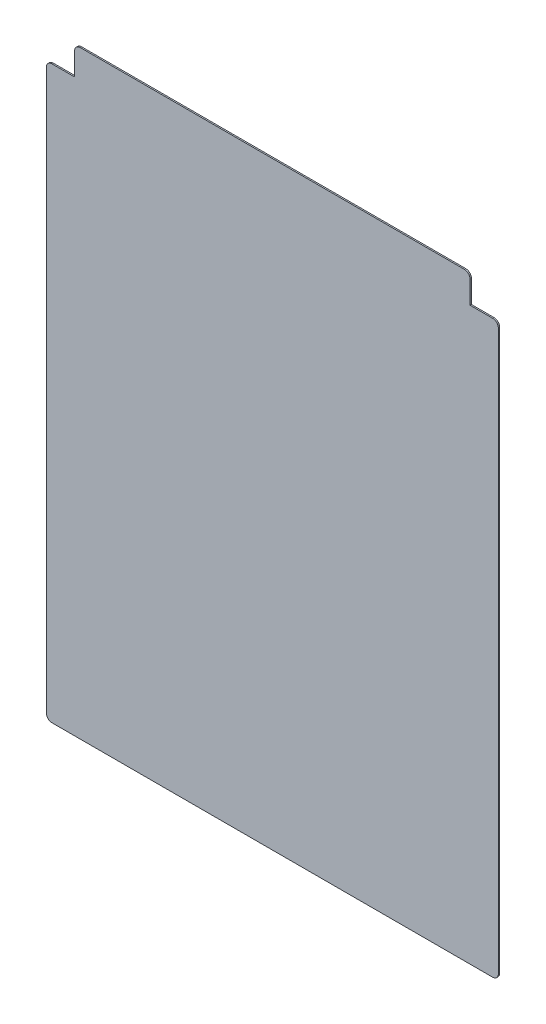
ISO-10303-21;
HEADER;
FILE_DESCRIPTION(('STEP AP214'),'2;1');
FILE_NAME('part.step','',(''),(''),'','','');
FILE_SCHEMA(('AUTOMOTIVE_DESIGN { 1 0 10303 214 1 1 1 1 }'));
ENDSEC;
DATA;
#1=APPLICATION_CONTEXT('core data for automotive mechanical design processes');
#2=APPLICATION_PROTOCOL_DEFINITION('international standard','automotive_design',2000,#1);
#3=PRODUCT_CONTEXT('',#1,'mechanical');
#4=PRODUCT('Part','Part','',(#3));
#5=PRODUCT_RELATED_PRODUCT_CATEGORY('part','',(#4));
#6=PRODUCT_DEFINITION_FORMATION('','',#4);
#7=PRODUCT_DEFINITION_CONTEXT('part definition',#1,'design');
#8=PRODUCT_DEFINITION('design','',#6,#7);
#9=PRODUCT_DEFINITION_SHAPE('','',#8);
#10=(LENGTH_UNIT() NAMED_UNIT(*) SI_UNIT(.MILLI.,.METRE.));
#11=(NAMED_UNIT(*) PLANE_ANGLE_UNIT() SI_UNIT($,.RADIAN.));
#12=(NAMED_UNIT(*) SI_UNIT($,.STERADIAN.) SOLID_ANGLE_UNIT());
#13=UNCERTAINTY_MEASURE_WITH_UNIT(LENGTH_MEASURE(1.E-05),#10,'distance_accuracy_value','');
#14=(GEOMETRIC_REPRESENTATION_CONTEXT(3) GLOBAL_UNCERTAINTY_ASSIGNED_CONTEXT((#13)) GLOBAL_UNIT_ASSIGNED_CONTEXT((#10,
#11,#12)) REPRESENTATION_CONTEXT('',''));
#15=CARTESIAN_POINT('',(0.,0.,0.));
#16=DIRECTION('',(0.,0.,1.));
#17=DIRECTION('',(1.,0.,0.));
#18=AXIS2_PLACEMENT_3D('',#15,#16,#17);
#19=CARTESIAN_POINT('',(-200.,0.,-1.2));
#20=DIRECTION('',(-1.,0.,0.));
#21=DIRECTION('',(0.,0.,1.));
#22=AXIS2_PLACEMENT_3D('',#19,#20,#21);
#23=PLANE('',#22);
#24=DIRECTION('',(0.,-1.,0.));
#25=VECTOR('',#24,1.);
#26=CARTESIAN_POINT('',(-200.,0.,-1.2));
#27=LINE('',#26,#25);
#28=CARTESIAN_POINT('',(-200.,500.,-1.2));
#29=VERTEX_POINT('',#28);
#30=CARTESIAN_POINT('',(-200.,5.,-1.2));
#31=VERTEX_POINT('',#30);
#32=EDGE_CURVE('E187',#29,#31,#27,.T.);
#33=ORIENTED_EDGE('',*,*,#32,.T.);
#34=DIRECTION('',(0.,0.,1.));
#35=VECTOR('',#34,1.);
#36=CARTESIAN_POINT('',(-200.,5.,-1.2));
#37=LINE('',#36,#35);
#38=CARTESIAN_POINT('',(-200.,5.,0.));
#39=VERTEX_POINT('',#38);
#40=EDGE_CURVE('E225',#31,#39,#37,.T.);
#41=ORIENTED_EDGE('',*,*,#40,.T.);
#42=DIRECTION('',(0.,-1.,0.));
#43=VECTOR('',#42,1.);
#44=CARTESIAN_POINT('',(-200.,0.,0.));
#45=LINE('',#44,#43);
#46=CARTESIAN_POINT('',(-200.,500.,0.));
#47=VERTEX_POINT('',#46);
#48=EDGE_CURVE('E167',#47,#39,#45,.T.);
#49=ORIENTED_EDGE('',*,*,#48,.F.);
#50=DIRECTION('',(0.,0.,1.));
#51=VECTOR('',#50,1.);
#52=CARTESIAN_POINT('',(-200.,500.,-1.2));
#53=LINE('',#52,#51);
#54=EDGE_CURVE('E223',#47,#29,#53,.F.);
#55=ORIENTED_EDGE('',*,*,#54,.T.);
#56=EDGE_LOOP('',(#33,#41,#49,#55));
#57=FACE_BOUND('',#56,.T.);
#58=ADVANCED_FACE('F37',(#57),#23,.T.);
#59=CARTESIAN_POINT('',(-200.,505.,-1.2));
#60=DIRECTION('',(0.,1.,0.));
#61=DIRECTION('',(0.,0.,1.));
#62=AXIS2_PLACEMENT_3D('',#59,#60,#61);
#63=PLANE('',#62);
#64=DIRECTION('',(-1.,0.,0.));
#65=VECTOR('',#64,1.);
#66=CARTESIAN_POINT('',(-200.,505.,-1.2));
#67=LINE('',#66,#65);
#68=CARTESIAN_POINT('',(-175.,505.,-1.2));
#69=VERTEX_POINT('',#68);
#70=CARTESIAN_POINT('',(-195.,505.,-1.2));
#71=VERTEX_POINT('',#70);
#72=EDGE_CURVE('E153',#69,#71,#67,.T.);
#73=ORIENTED_EDGE('',*,*,#72,.T.);
#74=DIRECTION('',(0.,0.,1.));
#75=VECTOR('',#74,1.);
#76=CARTESIAN_POINT('',(-195.,505.,-1.2));
#77=LINE('',#76,#75);
#78=CARTESIAN_POINT('',(-195.,505.,0.));
#79=VERTEX_POINT('',#78);
#80=EDGE_CURVE('E228',#71,#79,#77,.T.);
#81=ORIENTED_EDGE('',*,*,#80,.T.);
#82=DIRECTION('',(-1.,0.,0.));
#83=VECTOR('',#82,1.);
#84=CARTESIAN_POINT('',(-200.,505.,0.));
#85=LINE('',#84,#83);
#86=CARTESIAN_POINT('',(-175.,505.,0.));
#87=VERTEX_POINT('',#86);
#88=EDGE_CURVE('E184',#87,#79,#85,.T.);
#89=ORIENTED_EDGE('',*,*,#88,.F.);
#90=DIRECTION('',(0.,0.,1.));
#91=VECTOR('',#90,1.);
#92=CARTESIAN_POINT('',(-175.,505.,-1.2));
#93=LINE('',#92,#91);
#94=EDGE_CURVE('E152',#69,#87,#93,.T.);
#95=ORIENTED_EDGE('',*,*,#94,.F.);
#96=EDGE_LOOP('',(#73,#81,#89,#95));
#97=FACE_BOUND('',#96,.T.);
#98=ADVANCED_FACE('F262',(#97),#63,.T.);
#99=CARTESIAN_POINT('',(-175.,530.,-1.2));
#100=DIRECTION('',(-1.,0.,0.));
#101=DIRECTION('',(0.,0.,1.));
#102=AXIS2_PLACEMENT_3D('',#99,#100,#101);
#103=PLANE('',#102);
#104=DIRECTION('',(0.,-1.,0.));
#105=VECTOR('',#104,1.);
#106=CARTESIAN_POINT('',(-175.,530.,0.));
#107=LINE('',#106,#105);
#108=CARTESIAN_POINT('',(-175.,525.,0.));
#109=VERTEX_POINT('',#108);
#110=EDGE_CURVE('E182',#109,#87,#107,.T.);
#111=ORIENTED_EDGE('',*,*,#110,.F.);
#112=DIRECTION('',(0.,0.,1.));
#113=VECTOR('',#112,1.);
#114=CARTESIAN_POINT('',(-175.,525.,-1.2));
#115=LINE('',#114,#113);
#116=CARTESIAN_POINT('',(-175.,525.,-1.2));
#117=VERTEX_POINT('',#116);
#118=EDGE_CURVE('E236',#109,#117,#115,.F.);
#119=ORIENTED_EDGE('',*,*,#118,.T.);
#120=DIRECTION('',(0.,-1.,0.));
#121=VECTOR('',#120,1.);
#122=CARTESIAN_POINT('',(-175.,530.,-1.2));
#123=LINE('',#122,#121);
#124=EDGE_CURVE('E160',#117,#69,#123,.T.);
#125=ORIENTED_EDGE('',*,*,#124,.T.);
#126=ORIENTED_EDGE('',*,*,#94,.T.);
#127=EDGE_LOOP('',(#111,#119,#125,#126));
#128=FACE_BOUND('',#127,.T.);
#129=ADVANCED_FACE('F241',(#128),#103,.T.);
#130=CARTESIAN_POINT('',(-175.,530.,-1.2));
#131=DIRECTION('',(0.,1.,0.));
#132=DIRECTION('',(0.,0.,1.));
#133=AXIS2_PLACEMENT_3D('',#130,#131,#132);
#134=PLANE('',#133);
#135=DIRECTION('',(-1.,0.,0.));
#136=VECTOR('',#135,1.);
#137=CARTESIAN_POINT('',(-175.,530.,-1.2));
#138=LINE('',#137,#136);
#139=CARTESIAN_POINT('',(170.,530.,-1.2));
#140=VERTEX_POINT('',#139);
#141=CARTESIAN_POINT('',(-170.,530.,-1.2));
#142=VERTEX_POINT('',#141);
#143=EDGE_CURVE('E157',#140,#142,#138,.T.);
#144=ORIENTED_EDGE('',*,*,#143,.T.);
#145=DIRECTION('',(0.,0.,1.));
#146=VECTOR('',#145,1.);
#147=CARTESIAN_POINT('',(-170.,530.,-1.2));
#148=LINE('',#147,#146);
#149=CARTESIAN_POINT('',(-170.,530.,0.));
#150=VERTEX_POINT('',#149);
#151=EDGE_CURVE('E233',#142,#150,#148,.T.);
#152=ORIENTED_EDGE('',*,*,#151,.T.);
#153=DIRECTION('',(-1.,0.,0.));
#154=VECTOR('',#153,1.);
#155=CARTESIAN_POINT('',(-175.,530.,0.));
#156=LINE('',#155,#154);
#157=CARTESIAN_POINT('',(170.,530.,0.));
#158=VERTEX_POINT('',#157);
#159=EDGE_CURVE('E179',#158,#150,#156,.T.);
#160=ORIENTED_EDGE('',*,*,#159,.F.);
#161=DIRECTION('',(0.,0.,1.));
#162=VECTOR('',#161,1.);
#163=CARTESIAN_POINT('',(170.,530.,-1.2));
#164=LINE('',#163,#162);
#165=EDGE_CURVE('E231',#158,#140,#164,.F.);
#166=ORIENTED_EDGE('',*,*,#165,.T.);
#167=EDGE_LOOP('',(#144,#152,#160,#166));
#168=FACE_BOUND('',#167,.T.);
#169=ADVANCED_FACE('F250',(#168),#134,.T.);
#170=CARTESIAN_POINT('',(175.,530.,-1.2));
#171=DIRECTION('',(1.,0.,0.));
#172=DIRECTION('',(0.,1.,0.));
#173=AXIS2_PLACEMENT_3D('',#170,#171,#172);
#174=PLANE('',#173);
#175=DIRECTION('',(0.,1.,0.));
#176=VECTOR('',#175,1.);
#177=CARTESIAN_POINT('',(175.,530.,-1.2));
#178=LINE('',#177,#176);
#179=CARTESIAN_POINT('',(175.,505.,-1.2));
#180=VERTEX_POINT('',#179);
#181=CARTESIAN_POINT('',(175.,525.,-1.2));
#182=VERTEX_POINT('',#181);
#183=EDGE_CURVE('E144',#180,#182,#178,.T.);
#184=ORIENTED_EDGE('',*,*,#183,.T.);
#185=DIRECTION('',(0.,0.,1.));
#186=VECTOR('',#185,1.);
#187=CARTESIAN_POINT('',(175.,525.,-1.2));
#188=LINE('',#187,#186);
#189=CARTESIAN_POINT('',(175.,525.,0.));
#190=VERTEX_POINT('',#189);
#191=EDGE_CURVE('E11',#182,#190,#188,.T.);
#192=ORIENTED_EDGE('',*,*,#191,.T.);
#193=DIRECTION('',(0.,1.,0.));
#194=VECTOR('',#193,1.);
#195=CARTESIAN_POINT('',(175.,530.,0.));
#196=LINE('',#195,#194);
#197=CARTESIAN_POINT('',(175.,505.,0.));
#198=VERTEX_POINT('',#197);
#199=EDGE_CURVE('E151',#198,#190,#196,.T.);
#200=ORIENTED_EDGE('',*,*,#199,.F.);
#201=DIRECTION('',(0.,0.,1.));
#202=VECTOR('',#201,1.);
#203=CARTESIAN_POINT('',(175.,505.,-1.2));
#204=LINE('',#203,#202);
#205=EDGE_CURVE('E141',#180,#198,#204,.T.);
#206=ORIENTED_EDGE('',*,*,#205,.F.);
#207=EDGE_LOOP('',(#184,#192,#200,#206));
#208=FACE_BOUND('',#207,.T.);
#209=ADVANCED_FACE('F148',(#208),#174,.T.);
#210=CARTESIAN_POINT('',(200.,505.,-1.2));
#211=DIRECTION('',(0.,1.,0.));
#212=DIRECTION('',(0.,0.,1.));
#213=AXIS2_PLACEMENT_3D('',#210,#211,#212);
#214=PLANE('',#213);
#215=DIRECTION('',(-1.,0.,0.));
#216=VECTOR('',#215,1.);
#217=CARTESIAN_POINT('',(200.,505.,0.));
#218=LINE('',#217,#216);
#219=CARTESIAN_POINT('',(195.,505.,0.));
#220=VERTEX_POINT('',#219);
#221=EDGE_CURVE('E176',#220,#198,#218,.T.);
#222=ORIENTED_EDGE('',*,*,#221,.F.);
#223=DIRECTION('',(0.,0.,1.));
#224=VECTOR('',#223,1.);
#225=CARTESIAN_POINT('',(195.,505.,-1.2));
#226=LINE('',#225,#224);
#227=CARTESIAN_POINT('',(195.,505.,-1.2));
#228=VERTEX_POINT('',#227);
#229=EDGE_CURVE('E45',#220,#228,#226,.F.);
#230=ORIENTED_EDGE('',*,*,#229,.T.);
#231=DIRECTION('',(-1.,0.,0.));
#232=VECTOR('',#231,1.);
#233=CARTESIAN_POINT('',(200.,505.,-1.2));
#234=LINE('',#233,#232);
#235=EDGE_CURVE('E138',#228,#180,#234,.T.);
#236=ORIENTED_EDGE('',*,*,#235,.T.);
#237=ORIENTED_EDGE('',*,*,#205,.T.);
#238=EDGE_LOOP('',(#222,#230,#236,#237));
#239=FACE_BOUND('',#238,.T.);
#240=ADVANCED_FACE('F140',(#239),#214,.T.);
#241=CARTESIAN_POINT('',(200.,0.,-1.2));
#242=DIRECTION('',(1.,0.,0.));
#243=DIRECTION('',(0.,0.,-1.));
#244=AXIS2_PLACEMENT_3D('',#241,#242,#243);
#245=PLANE('',#244);
#246=DIRECTION('',(0.,1.,0.));
#247=VECTOR('',#246,1.);
#248=CARTESIAN_POINT('',(200.,0.,0.));
#249=LINE('',#248,#247);
#250=CARTESIAN_POINT('',(200.,5.,0.));
#251=VERTEX_POINT('',#250);
#252=CARTESIAN_POINT('',(200.,500.,0.));
#253=VERTEX_POINT('',#252);
#254=EDGE_CURVE('E173',#251,#253,#249,.T.);
#255=ORIENTED_EDGE('',*,*,#254,.F.);
#256=DIRECTION('',(0.,0.,1.));
#257=VECTOR('',#256,1.);
#258=CARTESIAN_POINT('',(200.,5.,-1.2));
#259=LINE('',#258,#257);
#260=CARTESIAN_POINT('',(200.,5.,-1.2));
#261=VERTEX_POINT('',#260);
#262=EDGE_CURVE('E210',#251,#261,#259,.F.);
#263=ORIENTED_EDGE('',*,*,#262,.T.);
#264=DIRECTION('',(0.,1.,0.));
#265=VECTOR('',#264,1.);
#266=CARTESIAN_POINT('',(200.,0.,-1.2));
#267=LINE('',#266,#265);
#268=CARTESIAN_POINT('',(200.,500.,-1.2));
#269=VERTEX_POINT('',#268);
#270=EDGE_CURVE('E145',#261,#269,#267,.T.);
#271=ORIENTED_EDGE('',*,*,#270,.T.);
#272=DIRECTION('',(0.,0.,1.));
#273=VECTOR('',#272,1.);
#274=CARTESIAN_POINT('',(200.,500.,-1.2));
#275=LINE('',#274,#273);
#276=EDGE_CURVE('E207',#269,#253,#275,.T.);
#277=ORIENTED_EDGE('',*,*,#276,.T.);
#278=EDGE_LOOP('',(#255,#263,#271,#277));
#279=FACE_BOUND('',#278,.T.);
#280=ADVANCED_FACE('F350',(#279),#245,.T.);
#281=CARTESIAN_POINT('',(-200.,0.,-1.2));
#282=DIRECTION('',(0.,-1.,0.));
#283=DIRECTION('',(0.,0.,-1.));
#284=AXIS2_PLACEMENT_3D('',#281,#282,#283);
#285=PLANE('',#284);
#286=DIRECTION('',(1.,0.,0.));
#287=VECTOR('',#286,1.);
#288=CARTESIAN_POINT('',(-200.,0.,-1.2));
#289=LINE('',#288,#287);
#290=CARTESIAN_POINT('',(-195.,0.,-1.2));
#291=VERTEX_POINT('',#290);
#292=CARTESIAN_POINT('',(195.,0.,-1.2));
#293=VERTEX_POINT('',#292);
#294=EDGE_CURVE('E437',#291,#293,#289,.T.);
#295=ORIENTED_EDGE('',*,*,#294,.T.);
#296=DIRECTION('',(0.,0.,1.));
#297=VECTOR('',#296,1.);
#298=CARTESIAN_POINT('',(195.,0.,-1.2));
#299=LINE('',#298,#297);
#300=CARTESIAN_POINT('',(195.,0.,0.));
#301=VERTEX_POINT('',#300);
#302=EDGE_CURVE('E192',#293,#301,#299,.T.);
#303=ORIENTED_EDGE('',*,*,#302,.T.);
#304=DIRECTION('',(1.,0.,0.));
#305=VECTOR('',#304,1.);
#306=CARTESIAN_POINT('',(-200.,0.,0.));
#307=LINE('',#306,#305);
#308=CARTESIAN_POINT('',(-195.,0.,0.));
#309=VERTEX_POINT('',#308);
#310=EDGE_CURVE('E170',#309,#301,#307,.T.);
#311=ORIENTED_EDGE('',*,*,#310,.F.);
#312=DIRECTION('',(0.,0.,1.));
#313=VECTOR('',#312,1.);
#314=CARTESIAN_POINT('',(-195.,0.,-1.2));
#315=LINE('',#314,#313);
#316=EDGE_CURVE('E189',#309,#291,#315,.F.);
#317=ORIENTED_EDGE('',*,*,#316,.T.);
#318=EDGE_LOOP('',(#295,#303,#311,#317));
#319=FACE_BOUND('',#318,.T.);
#320=ADVANCED_FACE('F273',(#319),#285,.T.);
#321=CARTESIAN_POINT('',(0.,0.,-1.2));
#322=DIRECTION('',(0.,0.,-1.));
#323=DIRECTION('',(-1.,0.,0.));
#324=AXIS2_PLACEMENT_3D('',#321,#322,#323);
#325=PLANE('',#324);
#326=ORIENTED_EDGE('',*,*,#270,.F.);
#327=CARTESIAN_POINT('',(195.,5.,-1.2));
#328=DIRECTION('',(0.,0.,-1.));
#329=DIRECTION('',(-1.,0.,0.));
#330=AXIS2_PLACEMENT_3D('',#327,#328,#329);
#331=CIRCLE('',#330,5.);
#332=EDGE_CURVE('E221',#261,#293,#331,.T.);
#333=ORIENTED_EDGE('',*,*,#332,.T.);
#334=ORIENTED_EDGE('',*,*,#294,.F.);
#335=CARTESIAN_POINT('',(-195.,5.,-1.2));
#336=DIRECTION('',(0.,0.,-1.));
#337=DIRECTION('',(-1.,0.,0.));
#338=AXIS2_PLACEMENT_3D('',#335,#336,#337);
#339=CIRCLE('',#338,5.);
#340=EDGE_CURVE('E219',#291,#31,#339,.T.);
#341=ORIENTED_EDGE('',*,*,#340,.T.);
#342=ORIENTED_EDGE('',*,*,#32,.F.);
#343=CARTESIAN_POINT('',(-195.,500.,-1.2));
#344=DIRECTION('',(0.,0.,-1.));
#345=DIRECTION('',(-1.,0.,0.));
#346=AXIS2_PLACEMENT_3D('',#343,#344,#345);
#347=CIRCLE('',#346,5.);
#348=EDGE_CURVE('E217',#29,#71,#347,.T.);
#349=ORIENTED_EDGE('',*,*,#348,.T.);
#350=ORIENTED_EDGE('',*,*,#72,.F.);
#351=ORIENTED_EDGE('',*,*,#124,.F.);
#352=CARTESIAN_POINT('',(-170.,525.,-1.2));
#353=DIRECTION('',(0.,0.,-1.));
#354=DIRECTION('',(-1.,0.,0.));
#355=AXIS2_PLACEMENT_3D('',#352,#353,#354);
#356=CIRCLE('',#355,5.);
#357=EDGE_CURVE('E215',#117,#142,#356,.T.);
#358=ORIENTED_EDGE('',*,*,#357,.T.);
#359=ORIENTED_EDGE('',*,*,#143,.F.);
#360=CARTESIAN_POINT('',(170.,525.,-1.2));
#361=DIRECTION('',(0.,0.,-1.));
#362=DIRECTION('',(-1.,0.,0.));
#363=AXIS2_PLACEMENT_3D('',#360,#361,#362);
#364=CIRCLE('',#363,5.);
#365=EDGE_CURVE('E59',#140,#182,#364,.T.);
#366=ORIENTED_EDGE('',*,*,#365,.T.);
#367=ORIENTED_EDGE('',*,*,#183,.F.);
#368=ORIENTED_EDGE('',*,*,#235,.F.);
#369=CARTESIAN_POINT('',(195.,500.,-1.2));
#370=DIRECTION('',(0.,0.,-1.));
#371=DIRECTION('',(-1.,0.,0.));
#372=AXIS2_PLACEMENT_3D('',#369,#370,#371);
#373=CIRCLE('',#372,5.);
#374=EDGE_CURVE('E213',#228,#269,#373,.T.);
#375=ORIENTED_EDGE('',*,*,#374,.T.);
#376=EDGE_LOOP('',(#326,#333,#334,#341,#342,#349,#350,#351,#358,#359,#366,#367,#368,#375));
#377=FACE_BOUND('',#376,.T.);
#378=ADVANCED_FACE('F156',(#377),#325,.T.);
#379=CARTESIAN_POINT('',(0.,0.,0.));
#380=DIRECTION('',(0.,0.,-1.));
#381=DIRECTION('',(-1.,0.,0.));
#382=AXIS2_PLACEMENT_3D('',#379,#380,#381);
#383=PLANE('',#382);
#384=ORIENTED_EDGE('',*,*,#310,.T.);
#385=CARTESIAN_POINT('',(195.,5.,0.));
#386=DIRECTION('',(0.,0.,-1.));
#387=DIRECTION('',(-1.,0.,0.));
#388=AXIS2_PLACEMENT_3D('',#385,#386,#387);
#389=CIRCLE('',#388,5.);
#390=EDGE_CURVE('E205',#301,#251,#389,.F.);
#391=ORIENTED_EDGE('',*,*,#390,.T.);
#392=ORIENTED_EDGE('',*,*,#254,.T.);
#393=CARTESIAN_POINT('',(195.,500.,0.));
#394=DIRECTION('',(0.,0.,-1.));
#395=DIRECTION('',(-1.,0.,0.));
#396=AXIS2_PLACEMENT_3D('',#393,#394,#395);
#397=CIRCLE('',#396,5.);
#398=EDGE_CURVE('E197',#253,#220,#397,.F.);
#399=ORIENTED_EDGE('',*,*,#398,.T.);
#400=ORIENTED_EDGE('',*,*,#221,.T.);
#401=ORIENTED_EDGE('',*,*,#199,.T.);
#402=CARTESIAN_POINT('',(170.,525.,0.));
#403=DIRECTION('',(0.,0.,-1.));
#404=DIRECTION('',(-1.,0.,0.));
#405=AXIS2_PLACEMENT_3D('',#402,#403,#404);
#406=CIRCLE('',#405,5.);
#407=EDGE_CURVE('E195',#190,#158,#406,.F.);
#408=ORIENTED_EDGE('',*,*,#407,.T.);
#409=ORIENTED_EDGE('',*,*,#159,.T.);
#410=CARTESIAN_POINT('',(-170.,525.,0.));
#411=DIRECTION('',(0.,0.,-1.));
#412=DIRECTION('',(-1.,0.,0.));
#413=AXIS2_PLACEMENT_3D('',#410,#411,#412);
#414=CIRCLE('',#413,5.);
#415=EDGE_CURVE('E199',#150,#109,#414,.F.);
#416=ORIENTED_EDGE('',*,*,#415,.T.);
#417=ORIENTED_EDGE('',*,*,#110,.T.);
#418=ORIENTED_EDGE('',*,*,#88,.T.);
#419=CARTESIAN_POINT('',(-195.,500.,0.));
#420=DIRECTION('',(0.,0.,-1.));
#421=DIRECTION('',(-1.,0.,0.));
#422=AXIS2_PLACEMENT_3D('',#419,#420,#421);
#423=CIRCLE('',#422,5.);
#424=EDGE_CURVE('E201',#79,#47,#423,.F.);
#425=ORIENTED_EDGE('',*,*,#424,.T.);
#426=ORIENTED_EDGE('',*,*,#48,.T.);
#427=CARTESIAN_POINT('',(-195.,5.,0.));
#428=DIRECTION('',(0.,0.,-1.));
#429=DIRECTION('',(-1.,0.,0.));
#430=AXIS2_PLACEMENT_3D('',#427,#428,#429);
#431=CIRCLE('',#430,5.);
#432=EDGE_CURVE('E203',#39,#309,#431,.F.);
#433=ORIENTED_EDGE('',*,*,#432,.T.);
#434=EDGE_LOOP('',(#384,#391,#392,#399,#400,#401,#408,#409,#416,#417,#418,#425,#426,#433));
#435=FACE_BOUND('',#434,.T.);
#436=ADVANCED_FACE('F253',(#435),#383,.F.);
#437=CARTESIAN_POINT('',(195.,5.,-1.2));
#438=DIRECTION('',(0.,0.,1.));
#439=DIRECTION('',(1.,0.,0.));
#440=AXIS2_PLACEMENT_3D('',#437,#438,#439);
#441=CYLINDRICAL_SURFACE('',#440,5.);
#442=ORIENTED_EDGE('',*,*,#332,.F.);
#443=ORIENTED_EDGE('',*,*,#262,.F.);
#444=ORIENTED_EDGE('',*,*,#390,.F.);
#445=ORIENTED_EDGE('',*,*,#302,.F.);
#446=EDGE_LOOP('',(#442,#443,#444,#445));
#447=FACE_BOUND('',#446,.T.);
#448=ADVANCED_FACE('F275',(#447),#441,.T.);
#449=CARTESIAN_POINT('',(-195.,5.,-1.2));
#450=DIRECTION('',(0.,0.,1.));
#451=DIRECTION('',(1.,0.,0.));
#452=AXIS2_PLACEMENT_3D('',#449,#450,#451);
#453=CYLINDRICAL_SURFACE('',#452,5.);
#454=ORIENTED_EDGE('',*,*,#340,.F.);
#455=ORIENTED_EDGE('',*,*,#316,.F.);
#456=ORIENTED_EDGE('',*,*,#432,.F.);
#457=ORIENTED_EDGE('',*,*,#40,.F.);
#458=EDGE_LOOP('',(#454,#455,#456,#457));
#459=FACE_BOUND('',#458,.T.);
#460=ADVANCED_FACE('F278',(#459),#453,.T.);
#461=CARTESIAN_POINT('',(-195.,500.,-1.2));
#462=DIRECTION('',(0.,0.,1.));
#463=DIRECTION('',(1.,0.,0.));
#464=AXIS2_PLACEMENT_3D('',#461,#462,#463);
#465=CYLINDRICAL_SURFACE('',#464,5.);
#466=ORIENTED_EDGE('',*,*,#348,.F.);
#467=ORIENTED_EDGE('',*,*,#54,.F.);
#468=ORIENTED_EDGE('',*,*,#424,.F.);
#469=ORIENTED_EDGE('',*,*,#80,.F.);
#470=EDGE_LOOP('',(#466,#467,#468,#469));
#471=FACE_BOUND('',#470,.T.);
#472=ADVANCED_FACE('F282',(#471),#465,.T.);
#473=CARTESIAN_POINT('',(-170.,525.,-1.2));
#474=DIRECTION('',(0.,0.,1.));
#475=DIRECTION('',(1.,0.,0.));
#476=AXIS2_PLACEMENT_3D('',#473,#474,#475);
#477=CYLINDRICAL_SURFACE('',#476,5.);
#478=ORIENTED_EDGE('',*,*,#357,.F.);
#479=ORIENTED_EDGE('',*,*,#118,.F.);
#480=ORIENTED_EDGE('',*,*,#415,.F.);
#481=ORIENTED_EDGE('',*,*,#151,.F.);
#482=EDGE_LOOP('',(#478,#479,#480,#481));
#483=FACE_BOUND('',#482,.T.);
#484=ADVANCED_FACE('F247',(#483),#477,.T.);
#485=CARTESIAN_POINT('',(195.,500.,-1.2));
#486=DIRECTION('',(0.,0.,1.));
#487=DIRECTION('',(1.,0.,0.));
#488=AXIS2_PLACEMENT_3D('',#485,#486,#487);
#489=CYLINDRICAL_SURFACE('',#488,5.);
#490=ORIENTED_EDGE('',*,*,#374,.F.);
#491=ORIENTED_EDGE('',*,*,#229,.F.);
#492=ORIENTED_EDGE('',*,*,#398,.F.);
#493=ORIENTED_EDGE('',*,*,#276,.F.);
#494=EDGE_LOOP('',(#490,#491,#492,#493));
#495=FACE_BOUND('',#494,.T.);
#496=ADVANCED_FACE('F256',(#495),#489,.T.);
#497=CARTESIAN_POINT('',(170.,525.,-1.2));
#498=DIRECTION('',(0.,0.,1.));
#499=DIRECTION('',(1.,0.,0.));
#500=AXIS2_PLACEMENT_3D('',#497,#498,#499);
#501=CYLINDRICAL_SURFACE('',#500,5.);
#502=ORIENTED_EDGE('',*,*,#365,.F.);
#503=ORIENTED_EDGE('',*,*,#165,.F.);
#504=ORIENTED_EDGE('',*,*,#407,.F.);
#505=ORIENTED_EDGE('',*,*,#191,.F.);
#506=EDGE_LOOP('',(#502,#503,#504,#505));
#507=FACE_BOUND('',#506,.T.);
#508=ADVANCED_FACE('F39',(#507),#501,.T.);
#509=CLOSED_SHELL('',(#58,#98,#129,#169,#209,#240,#280,#320,#378,#436,#448,#460,#472,#484,#496,#508));
#510=MANIFOLD_SOLID_BREP('B2',#509);
#511=ADVANCED_BREP_SHAPE_REPRESENTATION('',(#18,#510),#14);
#512=SHAPE_DEFINITION_REPRESENTATION(#9,#511);
ENDSEC;
END-ISO-10303-21;
